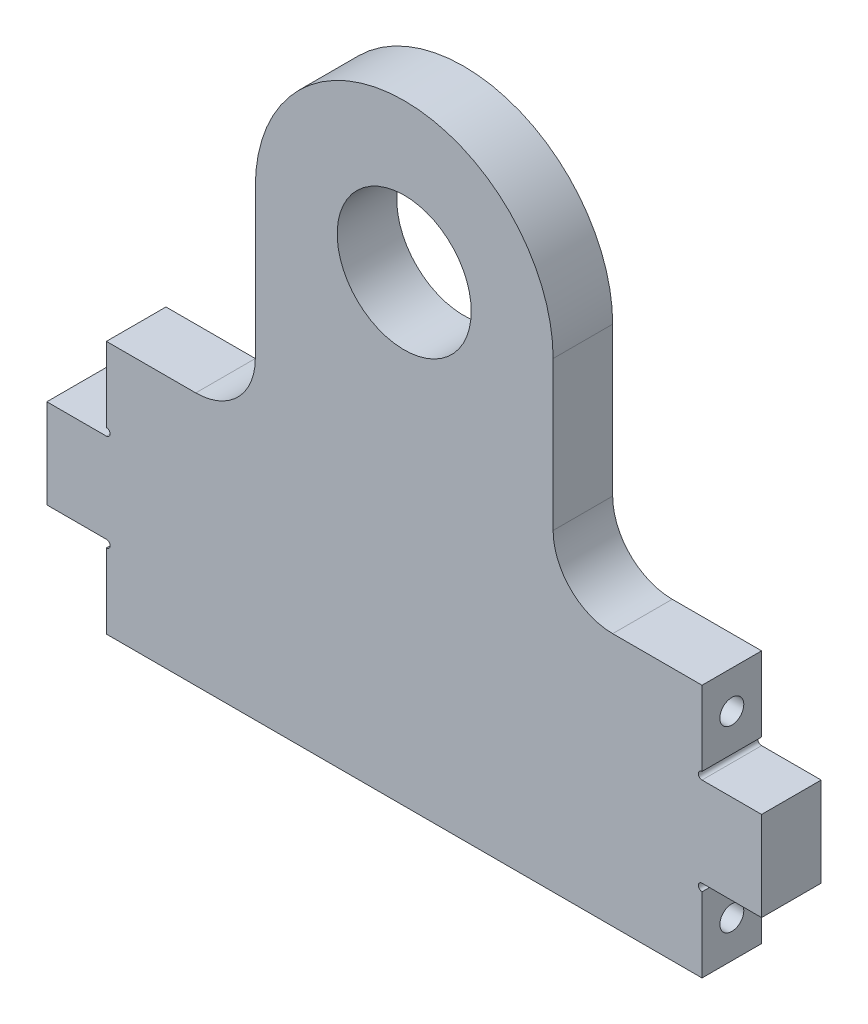
ISO-10303-21;
HEADER;
FILE_DESCRIPTION(('STEP AP214'),'2;1');
FILE_NAME('part.step','',(''),(''),'','','');
FILE_SCHEMA(('AUTOMOTIVE_DESIGN { 1 0 10303 214 1 1 1 1 }'));
ENDSEC;
DATA;
#1=APPLICATION_CONTEXT('core data for automotive mechanical design processes');
#2=APPLICATION_PROTOCOL_DEFINITION('international standard','automotive_design',2000,#1);
#3=PRODUCT_CONTEXT('',#1,'mechanical');
#4=PRODUCT('Part','Part','',(#3));
#5=PRODUCT_RELATED_PRODUCT_CATEGORY('part','',(#4));
#6=PRODUCT_DEFINITION_FORMATION('','',#4);
#7=PRODUCT_DEFINITION_CONTEXT('part definition',#1,'design');
#8=PRODUCT_DEFINITION('design','',#6,#7);
#9=PRODUCT_DEFINITION_SHAPE('','',#8);
#10=(LENGTH_UNIT() NAMED_UNIT(*) SI_UNIT(.MILLI.,.METRE.));
#11=(NAMED_UNIT(*) PLANE_ANGLE_UNIT() SI_UNIT($,.RADIAN.));
#12=(NAMED_UNIT(*) SI_UNIT($,.STERADIAN.) SOLID_ANGLE_UNIT());
#13=UNCERTAINTY_MEASURE_WITH_UNIT(LENGTH_MEASURE(1.E-05),#10,'distance_accuracy_value','');
#14=(GEOMETRIC_REPRESENTATION_CONTEXT(3) GLOBAL_UNCERTAINTY_ASSIGNED_CONTEXT((#13)) GLOBAL_UNIT_ASSIGNED_CONTEXT((#10,
#11,#12)) REPRESENTATION_CONTEXT('',''));
#15=CARTESIAN_POINT('',(0.,0.,0.));
#16=DIRECTION('',(0.,0.,1.));
#17=DIRECTION('',(1.,0.,0.));
#18=AXIS2_PLACEMENT_3D('',#15,#16,#17);
#19=CARTESIAN_POINT('',(0.,0.,12.7));
#20=DIRECTION('',(0.,0.,-1.));
#21=DIRECTION('',(-1.,0.,0.));
#22=AXIS2_PLACEMENT_3D('',#19,#20,#21);
#23=PLANE('',#22);
#24=CARTESIAN_POINT('',(0.,95.25,12.7));
#25=DIRECTION('',(0.,0.,1.));
#26=DIRECTION('',(1.,0.,0.));
#27=AXIS2_PLACEMENT_3D('',#24,#25,#26);
#28=CIRCLE('',#27,14.2875);
#29=CARTESIAN_POINT('',(14.2875,95.25,12.7));
#30=VERTEX_POINT('',#29);
#31=EDGE_CURVE('E238',#30,#30,#28,.T.);
#32=ORIENTED_EDGE('',*,*,#31,.F.);
#33=EDGE_LOOP('',(#32));
#34=FACE_BOUND('',#33,.T.);
#35=CARTESIAN_POINT('',(-63.5000000000001,13.4505000595411,12.7));
#36=DIRECTION('',(0.,0.,-1.));
#37=DIRECTION('',(-1.,0.,0.));
#38=AXIS2_PLACEMENT_3D('',#35,#36,#37);
#39=CIRCLE('',#38,0.793749999999993);
#40=CARTESIAN_POINT('',(-63.5,14.2442500595411,12.7));
#41=VERTEX_POINT('',#40);
#42=CARTESIAN_POINT('',(-63.5,12.6567500595411,12.7));
#43=VERTEX_POINT('',#42);
#44=EDGE_CURVE('E202',#41,#43,#39,.T.);
#45=ORIENTED_EDGE('',*,*,#44,.T.);
#46=DIRECTION('',(0.,-1.,0.));
#47=VECTOR('',#46,1.);
#48=CARTESIAN_POINT('',(-63.5,0.,12.7));
#49=LINE('',#48,#47);
#50=CARTESIAN_POINT('',(-63.5,-3.26149988091779,12.7));
#51=VERTEX_POINT('',#50);
#52=EDGE_CURVE('E213',#43,#51,#49,.T.);
#53=ORIENTED_EDGE('',*,*,#52,.T.);
#54=DIRECTION('',(1.,0.,0.));
#55=VECTOR('',#54,1.);
#56=CARTESIAN_POINT('',(-63.5,-3.26149988091779,12.7));
#57=LINE('',#56,#55);
#58=CARTESIAN_POINT('',(63.5000000000001,-3.26149988091779,12.7));
#59=VERTEX_POINT('',#58);
#60=EDGE_CURVE('E323',#51,#59,#57,.T.);
#61=ORIENTED_EDGE('',*,*,#60,.T.);
#62=DIRECTION('',(0.,1.,0.));
#63=VECTOR('',#62,1.);
#64=CARTESIAN_POINT('',(63.5,0.,12.7));
#65=LINE('',#64,#63);
#66=CARTESIAN_POINT('',(63.5,12.6567500595411,12.7));
#67=VERTEX_POINT('',#66);
#68=EDGE_CURVE('E262',#59,#67,#65,.T.);
#69=ORIENTED_EDGE('',*,*,#68,.T.);
#70=CARTESIAN_POINT('',(63.5000000000001,13.4505000595411,12.7));
#71=DIRECTION('',(0.,0.,1.));
#72=DIRECTION('',(1.,0.,0.));
#73=AXIS2_PLACEMENT_3D('',#70,#71,#72);
#74=CIRCLE('',#73,0.793749999999993);
#75=CARTESIAN_POINT('',(63.5000000000001,14.2442500595411,12.7));
#76=VERTEX_POINT('',#75);
#77=EDGE_CURVE('E462',#76,#67,#74,.T.);
#78=ORIENTED_EDGE('',*,*,#77,.F.);
#79=DIRECTION('',(-1.,0.,0.));
#80=VECTOR('',#79,1.);
#81=CARTESIAN_POINT('',(76.2,14.2442500595411,12.7));
#82=LINE('',#81,#80);
#83=CARTESIAN_POINT('',(76.2,14.2442500595411,12.7));
#84=VERTEX_POINT('',#83);
#85=EDGE_CURVE('E300',#84,#76,#82,.T.);
#86=ORIENTED_EDGE('',*,*,#85,.F.);
#87=DIRECTION('',(0.,-1.,0.));
#88=VECTOR('',#87,1.);
#89=CARTESIAN_POINT('',(76.2,33.2942500595411,12.7));
#90=LINE('',#89,#88);
#91=CARTESIAN_POINT('',(76.2,33.2942500595411,12.7));
#92=VERTEX_POINT('',#91);
#93=EDGE_CURVE('E285',#92,#84,#90,.T.);
#94=ORIENTED_EDGE('',*,*,#93,.F.);
#95=DIRECTION('',(-1.,0.,0.));
#96=VECTOR('',#95,1.);
#97=CARTESIAN_POINT('',(76.2,33.2942500595411,12.7));
#98=LINE('',#97,#96);
#99=CARTESIAN_POINT('',(63.5,33.2942500595411,12.7));
#100=VERTEX_POINT('',#99);
#101=EDGE_CURVE('E288',#92,#100,#98,.T.);
#102=ORIENTED_EDGE('',*,*,#101,.T.);
#103=CARTESIAN_POINT('',(63.5,34.0880000595411,12.7));
#104=DIRECTION('',(0.,0.,1.));
#105=DIRECTION('',(1.,0.,0.));
#106=AXIS2_PLACEMENT_3D('',#103,#104,#105);
#107=CIRCLE('',#106,0.793749999999993);
#108=CARTESIAN_POINT('',(63.5,34.8817500595411,12.7));
#109=VERTEX_POINT('',#108);
#110=EDGE_CURVE('E53',#109,#100,#107,.T.);
#111=ORIENTED_EDGE('',*,*,#110,.F.);
#112=CARTESIAN_POINT('',(63.5,50.8,12.7));
#113=VERTEX_POINT('',#112);
#114=EDGE_CURVE('E226',#109,#113,#65,.T.);
#115=ORIENTED_EDGE('',*,*,#114,.T.);
#116=DIRECTION('',(1.,0.,0.));
#117=VECTOR('',#116,1.);
#118=CARTESIAN_POINT('',(31.75,50.8,12.7));
#119=LINE('',#118,#117);
#120=CARTESIAN_POINT('',(44.45,50.8,12.7));
#121=VERTEX_POINT('',#120);
#122=EDGE_CURVE('E352',#121,#113,#119,.T.);
#123=ORIENTED_EDGE('',*,*,#122,.F.);
#124=CARTESIAN_POINT('',(44.45,63.5,12.7));
#125=DIRECTION('',(0.,0.,-1.));
#126=DIRECTION('',(-1.,0.,0.));
#127=AXIS2_PLACEMENT_3D('',#124,#125,#126);
#128=CIRCLE('',#127,12.7);
#129=CARTESIAN_POINT('',(31.75,63.5,12.7));
#130=VERTEX_POINT('',#129);
#131=EDGE_CURVE('E45',#121,#130,#128,.T.);
#132=ORIENTED_EDGE('',*,*,#131,.T.);
#133=DIRECTION('',(0.,-1.,0.));
#134=VECTOR('',#133,1.);
#135=CARTESIAN_POINT('',(31.75,95.25,12.7));
#136=LINE('',#135,#134);
#137=CARTESIAN_POINT('',(31.75,95.25,12.7));
#138=VERTEX_POINT('',#137);
#139=EDGE_CURVE('E350',#138,#130,#136,.T.);
#140=ORIENTED_EDGE('',*,*,#139,.F.);
#141=CARTESIAN_POINT('',(0.,95.25,12.7));
#142=DIRECTION('',(0.,0.,-1.));
#143=DIRECTION('',(1.,0.,0.));
#144=AXIS2_PLACEMENT_3D('',#141,#142,#143);
#145=CIRCLE('',#144,31.75);
#146=CARTESIAN_POINT('',(-31.75,95.25,12.7));
#147=VERTEX_POINT('',#146);
#148=EDGE_CURVE('E331',#147,#138,#145,.T.);
#149=ORIENTED_EDGE('',*,*,#148,.F.);
#150=DIRECTION('',(0.,1.,0.));
#151=VECTOR('',#150,1.);
#152=CARTESIAN_POINT('',(-31.75,50.8,12.7));
#153=LINE('',#152,#151);
#154=CARTESIAN_POINT('',(-31.75,63.5,12.7));
#155=VERTEX_POINT('',#154);
#156=EDGE_CURVE('E337',#155,#147,#153,.T.);
#157=ORIENTED_EDGE('',*,*,#156,.F.);
#158=CARTESIAN_POINT('',(-44.45,63.5,12.7));
#159=DIRECTION('',(0.,0.,-1.));
#160=DIRECTION('',(-1.,0.,0.));
#161=AXIS2_PLACEMENT_3D('',#158,#159,#160);
#162=CIRCLE('',#161,12.7);
#163=CARTESIAN_POINT('',(-44.45,50.8,12.7));
#164=VERTEX_POINT('',#163);
#165=EDGE_CURVE('E414',#155,#164,#162,.T.);
#166=ORIENTED_EDGE('',*,*,#165,.T.);
#167=DIRECTION('',(1.,0.,0.));
#168=VECTOR('',#167,1.);
#169=CARTESIAN_POINT('',(-63.5,50.8,12.7));
#170=LINE('',#169,#168);
#171=CARTESIAN_POINT('',(-63.5,50.8,12.7));
#172=VERTEX_POINT('',#171);
#173=EDGE_CURVE('E355',#172,#164,#170,.T.);
#174=ORIENTED_EDGE('',*,*,#173,.F.);
#175=CARTESIAN_POINT('',(-63.5,34.8817500595411,12.7));
#176=VERTEX_POINT('',#175);
#177=EDGE_CURVE('E223',#172,#176,#49,.T.);
#178=ORIENTED_EDGE('',*,*,#177,.T.);
#179=CARTESIAN_POINT('',(-63.5,34.0880000595411,12.7));
#180=DIRECTION('',(0.,0.,-1.));
#181=DIRECTION('',(-1.,0.,0.));
#182=AXIS2_PLACEMENT_3D('',#179,#180,#181);
#183=CIRCLE('',#182,0.793749999999993);
#184=CARTESIAN_POINT('',(-63.5,33.2942500595411,12.7));
#185=VERTEX_POINT('',#184);
#186=EDGE_CURVE('E209',#176,#185,#183,.T.);
#187=ORIENTED_EDGE('',*,*,#186,.T.);
#188=DIRECTION('',(1.,0.,0.));
#189=VECTOR('',#188,1.);
#190=CARTESIAN_POINT('',(-76.2,33.2942500595411,12.7));
#191=LINE('',#190,#189);
#192=CARTESIAN_POINT('',(-76.2,33.2942500595411,12.7));
#193=VERTEX_POINT('',#192);
#194=EDGE_CURVE('E784',#193,#185,#191,.T.);
#195=ORIENTED_EDGE('',*,*,#194,.F.);
#196=DIRECTION('',(0.,-1.,0.));
#197=VECTOR('',#196,1.);
#198=CARTESIAN_POINT('',(-76.2,33.2942500595411,12.7));
#199=LINE('',#198,#197);
#200=CARTESIAN_POINT('',(-76.2,14.2442500595411,12.7));
#201=VERTEX_POINT('',#200);
#202=EDGE_CURVE('E791',#193,#201,#199,.T.);
#203=ORIENTED_EDGE('',*,*,#202,.T.);
#204=DIRECTION('',(1.,0.,0.));
#205=VECTOR('',#204,1.);
#206=CARTESIAN_POINT('',(-76.2,14.2442500595411,12.7));
#207=LINE('',#206,#205);
#208=EDGE_CURVE('E216',#201,#41,#207,.T.);
#209=ORIENTED_EDGE('',*,*,#208,.T.);
#210=EDGE_LOOP('',(#45,#53,#61,#69,#78,#86,#94,#102,#111,#115,#123,#132,#140,#149,#157,#166,
#174,#178,#187,#195,#203,#209));
#211=FACE_BOUND('',#210,.T.);
#212=ADVANCED_FACE('F35',(#34,#211),#23,.F.);
#213=CARTESIAN_POINT('',(0.,0.,0.));
#214=DIRECTION('',(0.,0.,-1.));
#215=DIRECTION('',(-1.,0.,0.));
#216=AXIS2_PLACEMENT_3D('',#213,#214,#215);
#217=PLANE('',#216);
#218=CARTESIAN_POINT('',(0.,95.25,0.));
#219=DIRECTION('',(0.,0.,1.));
#220=DIRECTION('',(1.,0.,0.));
#221=AXIS2_PLACEMENT_3D('',#218,#219,#220);
#222=CIRCLE('',#221,14.2875);
#223=CARTESIAN_POINT('',(14.2875,95.25,0.));
#224=VERTEX_POINT('',#223);
#225=EDGE_CURVE('E367',#224,#224,#222,.T.);
#226=ORIENTED_EDGE('',*,*,#225,.T.);
#227=EDGE_LOOP('',(#226));
#228=FACE_BOUND('',#227,.T.);
#229=DIRECTION('',(0.,-1.,0.));
#230=VECTOR('',#229,1.);
#231=CARTESIAN_POINT('',(-63.5,0.,0.));
#232=LINE('',#231,#230);
#233=CARTESIAN_POINT('',(-63.5,12.6567500595411,0.));
#234=VERTEX_POINT('',#233);
#235=CARTESIAN_POINT('',(-63.5,-3.26149988091779,0.));
#236=VERTEX_POINT('',#235);
#237=EDGE_CURVE('E39',#234,#236,#232,.T.);
#238=ORIENTED_EDGE('',*,*,#237,.F.);
#239=CARTESIAN_POINT('',(-63.5000000000001,13.4505000595411,0.));
#240=DIRECTION('',(0.,0.,-1.));
#241=DIRECTION('',(-1.,0.,0.));
#242=AXIS2_PLACEMENT_3D('',#239,#240,#241);
#243=CIRCLE('',#242,0.793749999999993);
#244=CARTESIAN_POINT('',(-63.5000000000001,14.2442500595411,0.));
#245=VERTEX_POINT('',#244);
#246=EDGE_CURVE('E205',#234,#245,#243,.F.);
#247=ORIENTED_EDGE('',*,*,#246,.T.);
#248=DIRECTION('',(1.,0.,0.));
#249=VECTOR('',#248,1.);
#250=CARTESIAN_POINT('',(-76.2,14.2442500595411,0.));
#251=LINE('',#250,#249);
#252=CARTESIAN_POINT('',(-76.2,14.2442500595411,0.));
#253=VERTEX_POINT('',#252);
#254=EDGE_CURVE('E794',#253,#245,#251,.T.);
#255=ORIENTED_EDGE('',*,*,#254,.F.);
#256=DIRECTION('',(0.,1.,0.));
#257=VECTOR('',#256,1.);
#258=CARTESIAN_POINT('',(-76.2,33.2942500595411,0.));
#259=LINE('',#258,#257);
#260=CARTESIAN_POINT('',(-76.2,33.2942500595411,0.));
#261=VERTEX_POINT('',#260);
#262=EDGE_CURVE('E799',#253,#261,#259,.T.);
#263=ORIENTED_EDGE('',*,*,#262,.T.);
#264=DIRECTION('',(1.,0.,0.));
#265=VECTOR('',#264,1.);
#266=CARTESIAN_POINT('',(-76.2,33.2942500595411,0.));
#267=LINE('',#266,#265);
#268=CARTESIAN_POINT('',(-63.5,33.2942500595411,0.));
#269=VERTEX_POINT('',#268);
#270=EDGE_CURVE('E797',#261,#269,#267,.T.);
#271=ORIENTED_EDGE('',*,*,#270,.T.);
#272=CARTESIAN_POINT('',(-63.5,34.0880000595411,0.));
#273=DIRECTION('',(0.,0.,-1.));
#274=DIRECTION('',(-1.,0.,0.));
#275=AXIS2_PLACEMENT_3D('',#272,#273,#274);
#276=CIRCLE('',#275,0.793749999999993);
#277=CARTESIAN_POINT('',(-63.5,34.8817500595411,0.));
#278=VERTEX_POINT('',#277);
#279=EDGE_CURVE('E810',#269,#278,#276,.F.);
#280=ORIENTED_EDGE('',*,*,#279,.T.);
#281=CARTESIAN_POINT('',(-63.5,50.8,0.));
#282=VERTEX_POINT('',#281);
#283=EDGE_CURVE('E245',#282,#278,#232,.T.);
#284=ORIENTED_EDGE('',*,*,#283,.F.);
#285=DIRECTION('',(1.,0.,0.));
#286=VECTOR('',#285,1.);
#287=CARTESIAN_POINT('',(-63.5,50.8,0.));
#288=LINE('',#287,#286);
#289=CARTESIAN_POINT('',(-44.45,50.8,0.));
#290=VERTEX_POINT('',#289);
#291=EDGE_CURVE('E342',#282,#290,#288,.T.);
#292=ORIENTED_EDGE('',*,*,#291,.T.);
#293=CARTESIAN_POINT('',(-44.45,63.5,0.));
#294=DIRECTION('',(0.,0.,-1.));
#295=DIRECTION('',(-1.,0.,0.));
#296=AXIS2_PLACEMENT_3D('',#293,#294,#295);
#297=CIRCLE('',#296,12.7);
#298=CARTESIAN_POINT('',(-31.75,63.5,0.));
#299=VERTEX_POINT('',#298);
#300=EDGE_CURVE('E410',#290,#299,#297,.F.);
#301=ORIENTED_EDGE('',*,*,#300,.T.);
#302=DIRECTION('',(0.,1.,0.));
#303=VECTOR('',#302,1.);
#304=CARTESIAN_POINT('',(-31.75,50.8,0.));
#305=LINE('',#304,#303);
#306=CARTESIAN_POINT('',(-31.75,95.25,0.));
#307=VERTEX_POINT('',#306);
#308=EDGE_CURVE('E345',#299,#307,#305,.T.);
#309=ORIENTED_EDGE('',*,*,#308,.T.);
#310=CARTESIAN_POINT('',(0.,95.25,0.));
#311=DIRECTION('',(0.,0.,-1.));
#312=DIRECTION('',(1.,0.,0.));
#313=AXIS2_PLACEMENT_3D('',#310,#311,#312);
#314=CIRCLE('',#313,31.75);
#315=CARTESIAN_POINT('',(31.75,95.25,0.));
#316=VERTEX_POINT('',#315);
#317=EDGE_CURVE('E333',#307,#316,#314,.T.);
#318=ORIENTED_EDGE('',*,*,#317,.T.);
#319=DIRECTION('',(0.,-1.,0.));
#320=VECTOR('',#319,1.);
#321=CARTESIAN_POINT('',(31.75,95.25,0.));
#322=LINE('',#321,#320);
#323=CARTESIAN_POINT('',(31.75,63.5,0.));
#324=VERTEX_POINT('',#323);
#325=EDGE_CURVE('E336',#316,#324,#322,.T.);
#326=ORIENTED_EDGE('',*,*,#325,.T.);
#327=CARTESIAN_POINT('',(44.45,63.5,0.));
#328=DIRECTION('',(0.,0.,-1.));
#329=DIRECTION('',(-1.,0.,0.));
#330=AXIS2_PLACEMENT_3D('',#327,#328,#329);
#331=CIRCLE('',#330,12.7);
#332=CARTESIAN_POINT('',(44.45,50.8,0.));
#333=VERTEX_POINT('',#332);
#334=EDGE_CURVE('E11',#324,#333,#331,.F.);
#335=ORIENTED_EDGE('',*,*,#334,.T.);
#336=DIRECTION('',(1.,0.,0.));
#337=VECTOR('',#336,1.);
#338=CARTESIAN_POINT('',(31.75,50.8,0.));
#339=LINE('',#338,#337);
#340=CARTESIAN_POINT('',(63.5,50.8,0.));
#341=VERTEX_POINT('',#340);
#342=EDGE_CURVE('E339',#333,#341,#339,.T.);
#343=ORIENTED_EDGE('',*,*,#342,.T.);
#344=DIRECTION('',(0.,1.,0.));
#345=VECTOR('',#344,1.);
#346=CARTESIAN_POINT('',(63.5,0.,0.));
#347=LINE('',#346,#345);
#348=CARTESIAN_POINT('',(63.5,34.8817500595411,0.));
#349=VERTEX_POINT('',#348);
#350=EDGE_CURVE('E229',#349,#341,#347,.T.);
#351=ORIENTED_EDGE('',*,*,#350,.F.);
#352=CARTESIAN_POINT('',(63.5,34.0880000595411,0.));
#353=DIRECTION('',(0.,0.,-1.));
#354=DIRECTION('',(-1.,0.,0.));
#355=AXIS2_PLACEMENT_3D('',#352,#353,#354);
#356=CIRCLE('',#355,0.793749999999993);
#357=CARTESIAN_POINT('',(63.5,33.2942500595411,0.));
#358=VERTEX_POINT('',#357);
#359=EDGE_CURVE('E443',#358,#349,#356,.T.);
#360=ORIENTED_EDGE('',*,*,#359,.F.);
#361=DIRECTION('',(-1.,0.,0.));
#362=VECTOR('',#361,1.);
#363=CARTESIAN_POINT('',(76.2,33.2942500595411,0.));
#364=LINE('',#363,#362);
#365=CARTESIAN_POINT('',(76.2,33.2942500595411,0.));
#366=VERTEX_POINT('',#365);
#367=EDGE_CURVE('E291',#366,#358,#364,.T.);
#368=ORIENTED_EDGE('',*,*,#367,.F.);
#369=DIRECTION('',(0.,1.,0.));
#370=VECTOR('',#369,1.);
#371=CARTESIAN_POINT('',(76.2,33.2942500595411,0.));
#372=LINE('',#371,#370);
#373=CARTESIAN_POINT('',(76.2,14.2442500595411,0.));
#374=VERTEX_POINT('',#373);
#375=EDGE_CURVE('E455',#374,#366,#372,.T.);
#376=ORIENTED_EDGE('',*,*,#375,.F.);
#377=DIRECTION('',(-1.,0.,0.));
#378=VECTOR('',#377,1.);
#379=CARTESIAN_POINT('',(76.2,14.2442500595411,0.));
#380=LINE('',#379,#378);
#381=CARTESIAN_POINT('',(63.5,14.2442500595411,0.));
#382=VERTEX_POINT('',#381);
#383=EDGE_CURVE('E271',#374,#382,#380,.T.);
#384=ORIENTED_EDGE('',*,*,#383,.T.);
#385=CARTESIAN_POINT('',(63.5000000000001,13.4505000595411,0.));
#386=DIRECTION('',(0.,0.,-1.));
#387=DIRECTION('',(-1.,0.,0.));
#388=AXIS2_PLACEMENT_3D('',#385,#386,#387);
#389=CIRCLE('',#388,0.793749999999993);
#390=CARTESIAN_POINT('',(63.5,12.6567500595411,0.));
#391=VERTEX_POINT('',#390);
#392=EDGE_CURVE('E465',#391,#382,#389,.T.);
#393=ORIENTED_EDGE('',*,*,#392,.F.);
#394=CARTESIAN_POINT('',(63.5000000000001,-3.26149988091779,0.));
#395=VERTEX_POINT('',#394);
#396=EDGE_CURVE('E224',#395,#391,#347,.T.);
#397=ORIENTED_EDGE('',*,*,#396,.F.);
#398=DIRECTION('',(1.,0.,0.));
#399=VECTOR('',#398,1.);
#400=CARTESIAN_POINT('',(-63.5,-3.26149988091779,0.));
#401=LINE('',#400,#399);
#402=EDGE_CURVE('E324',#236,#395,#401,.T.);
#403=ORIENTED_EDGE('',*,*,#402,.F.);
#404=EDGE_LOOP('',(#238,#247,#255,#263,#271,#280,#284,#292,#301,#309,#318,#326,#335,#343,#351,
#360,#368,#376,#384,#393,#397,#403));
#405=FACE_BOUND('',#404,.T.);
#406=ADVANCED_FACE('F377',(#228,#405),#217,.T.);
#407=CARTESIAN_POINT('',(-63.5,0.,12.7));
#408=DIRECTION('',(1.,0.,0.));
#409=DIRECTION('',(0.,0.,-1.));
#410=AXIS2_PLACEMENT_3D('',#407,#408,#409);
#411=PLANE('',#410);
#412=CARTESIAN_POINT('',(-63.5,4.7192500595411,6.35));
#413=DIRECTION('',(-1.,0.,0.));
#414=DIRECTION('',(0.,0.,1.));
#415=AXIS2_PLACEMENT_3D('',#412,#413,#414);
#416=CIRCLE('',#415,2.55269999999999);
#417=CARTESIAN_POINT('',(-63.5,4.7192500595411,8.90269999999999));
#418=VERTEX_POINT('',#417);
#419=EDGE_CURVE('E470',#418,#418,#416,.T.);
#420=ORIENTED_EDGE('',*,*,#419,.F.);
#421=EDGE_LOOP('',(#420));
#422=FACE_BOUND('',#421,.T.);
#423=DIRECTION('',(0.,0.,1.));
#424=VECTOR('',#423,1.);
#425=CARTESIAN_POINT('',(-63.5,12.6567500595411,-4.99999999997031E-05));
#426=LINE('',#425,#424);
#427=EDGE_CURVE('E199',#234,#43,#426,.T.);
#428=ORIENTED_EDGE('',*,*,#427,.F.);
#429=ORIENTED_EDGE('',*,*,#237,.T.);
#430=DIRECTION('',(0.,0.,1.));
#431=VECTOR('',#430,1.);
#432=CARTESIAN_POINT('',(-63.5,-3.26149988091779,0.));
#433=LINE('',#432,#431);
#434=EDGE_CURVE('E221',#236,#51,#433,.T.);
#435=ORIENTED_EDGE('',*,*,#434,.T.);
#436=ORIENTED_EDGE('',*,*,#52,.F.);
#437=EDGE_LOOP('',(#428,#429,#435,#436));
#438=FACE_BOUND('',#437,.T.);
#439=ADVANCED_FACE('F219',(#422,#438),#411,.F.);
#440=CARTESIAN_POINT('',(-63.5,42.8192500595411,6.35));
#441=DIRECTION('',(-1.,0.,0.));
#442=DIRECTION('',(0.,0.,1.));
#443=AXIS2_PLACEMENT_3D('',#440,#441,#442);
#444=CIRCLE('',#443,2.55269999999999);
#445=CARTESIAN_POINT('',(-63.5,42.8192500595411,8.9027));
#446=VERTEX_POINT('',#445);
#447=EDGE_CURVE('E779',#446,#446,#444,.T.);
#448=ORIENTED_EDGE('',*,*,#447,.F.);
#449=EDGE_LOOP('',(#448));
#450=FACE_BOUND('',#449,.T.);
#451=DIRECTION('',(0.,0.,1.));
#452=VECTOR('',#451,1.);
#453=CARTESIAN_POINT('',(-63.5,34.8817500595411,-4.99999999997031E-05));
#454=LINE('',#453,#452);
#455=EDGE_CURVE('E808',#176,#278,#454,.F.);
#456=ORIENTED_EDGE('',*,*,#455,.F.);
#457=ORIENTED_EDGE('',*,*,#177,.F.);
#458=DIRECTION('',(0.,0.,1.));
#459=VECTOR('',#458,1.);
#460=CARTESIAN_POINT('',(-63.5,50.8,0.));
#461=LINE('',#460,#459);
#462=EDGE_CURVE('E362',#282,#172,#461,.T.);
#463=ORIENTED_EDGE('',*,*,#462,.F.);
#464=ORIENTED_EDGE('',*,*,#283,.T.);
#465=EDGE_LOOP('',(#456,#457,#463,#464));
#466=FACE_BOUND('',#465,.T.);
#467=ADVANCED_FACE('F391',(#450,#466),#411,.F.);
#468=CARTESIAN_POINT('',(63.5,0.,12.7));
#469=DIRECTION('',(-1.,0.,0.));
#470=DIRECTION('',(0.,0.,1.));
#471=AXIS2_PLACEMENT_3D('',#468,#469,#470);
#472=PLANE('',#471);
#473=CARTESIAN_POINT('',(63.5,42.8192500595411,6.35));
#474=DIRECTION('',(1.,0.,0.));
#475=DIRECTION('',(0.,0.,-1.));
#476=AXIS2_PLACEMENT_3D('',#473,#474,#475);
#477=CIRCLE('',#476,2.55269999999999);
#478=CARTESIAN_POINT('',(63.5,42.8192500595411,3.79730000000001));
#479=VERTEX_POINT('',#478);
#480=EDGE_CURVE('E280',#479,#479,#477,.T.);
#481=ORIENTED_EDGE('',*,*,#480,.F.);
#482=EDGE_LOOP('',(#481));
#483=FACE_BOUND('',#482,.T.);
#484=ORIENTED_EDGE('',*,*,#114,.F.);
#485=DIRECTION('',(0.,0.,1.));
#486=VECTOR('',#485,1.);
#487=CARTESIAN_POINT('',(63.5,34.8817500595411,-4.99999999997031E-05));
#488=LINE('',#487,#486);
#489=EDGE_CURVE('E270',#109,#349,#488,.F.);
#490=ORIENTED_EDGE('',*,*,#489,.T.);
#491=ORIENTED_EDGE('',*,*,#350,.T.);
#492=DIRECTION('',(0.,0.,1.));
#493=VECTOR('',#492,1.);
#494=CARTESIAN_POINT('',(63.5,50.8,0.));
#495=LINE('',#494,#493);
#496=EDGE_CURVE('E364',#341,#113,#495,.T.);
#497=ORIENTED_EDGE('',*,*,#496,.T.);
#498=EDGE_LOOP('',(#484,#490,#491,#497));
#499=FACE_BOUND('',#498,.T.);
#500=ADVANCED_FACE('F387',(#483,#499),#472,.F.);
#501=CARTESIAN_POINT('',(63.5,4.7192500595411,6.35));
#502=DIRECTION('',(1.,0.,0.));
#503=DIRECTION('',(0.,0.,-1.));
#504=AXIS2_PLACEMENT_3D('',#501,#502,#503);
#505=CIRCLE('',#504,2.55269999999999);
#506=CARTESIAN_POINT('',(63.5,4.7192500595411,3.79730000000001));
#507=VERTEX_POINT('',#506);
#508=EDGE_CURVE('E314',#507,#507,#505,.T.);
#509=ORIENTED_EDGE('',*,*,#508,.F.);
#510=EDGE_LOOP('',(#509));
#511=FACE_BOUND('',#510,.T.);
#512=ORIENTED_EDGE('',*,*,#396,.T.);
#513=DIRECTION('',(0.,0.,1.));
#514=VECTOR('',#513,1.);
#515=CARTESIAN_POINT('',(63.5,12.6567500595411,-4.99999999997031E-05));
#516=LINE('',#515,#514);
#517=EDGE_CURVE('E446',#391,#67,#516,.T.);
#518=ORIENTED_EDGE('',*,*,#517,.T.);
#519=ORIENTED_EDGE('',*,*,#68,.F.);
#520=DIRECTION('',(0.,0.,1.));
#521=VECTOR('',#520,1.);
#522=CARTESIAN_POINT('',(63.5000000000001,-3.26149988091779,0.));
#523=LINE('',#522,#521);
#524=EDGE_CURVE('E328',#395,#59,#523,.T.);
#525=ORIENTED_EDGE('',*,*,#524,.F.);
#526=EDGE_LOOP('',(#512,#518,#519,#525));
#527=FACE_BOUND('',#526,.T.);
#528=ADVANCED_FACE('F390',(#511,#527),#472,.F.);
#529=CARTESIAN_POINT('',(0.,95.25,0.));
#530=DIRECTION('',(0.,0.,1.));
#531=DIRECTION('',(1.,0.,0.));
#532=AXIS2_PLACEMENT_3D('',#529,#530,#531);
#533=CYLINDRICAL_SURFACE('',#532,14.2875);
#534=ORIENTED_EDGE('',*,*,#225,.F.);
#535=EDGE_LOOP('',(#534));
#536=FACE_BOUND('',#535,.T.);
#537=ORIENTED_EDGE('',*,*,#31,.T.);
#538=EDGE_LOOP('',(#537));
#539=FACE_BOUND('',#538,.T.);
#540=ADVANCED_FACE('F374',(#536,#539),#533,.F.);
#541=CARTESIAN_POINT('',(0.,95.25,0.));
#542=DIRECTION('',(0.,0.,1.));
#543=DIRECTION('',(1.,0.,0.));
#544=AXIS2_PLACEMENT_3D('',#541,#542,#543);
#545=CYLINDRICAL_SURFACE('',#544,31.75);
#546=ORIENTED_EDGE('',*,*,#148,.T.);
#547=DIRECTION('',(0.,0.,1.));
#548=VECTOR('',#547,1.);
#549=CARTESIAN_POINT('',(31.75,95.25,0.));
#550=LINE('',#549,#548);
#551=EDGE_CURVE('E347',#316,#138,#550,.T.);
#552=ORIENTED_EDGE('',*,*,#551,.F.);
#553=ORIENTED_EDGE('',*,*,#317,.F.);
#554=DIRECTION('',(0.,0.,1.));
#555=VECTOR('',#554,1.);
#556=CARTESIAN_POINT('',(-31.75,95.25,0.));
#557=LINE('',#556,#555);
#558=EDGE_CURVE('E359',#307,#147,#557,.T.);
#559=ORIENTED_EDGE('',*,*,#558,.T.);
#560=EDGE_LOOP('',(#546,#552,#553,#559));
#561=FACE_BOUND('',#560,.T.);
#562=ADVANCED_FACE('F430',(#561),#545,.T.);
#563=CARTESIAN_POINT('',(-31.75,50.8,0.));
#564=DIRECTION('',(1.,0.,0.));
#565=DIRECTION('',(0.,0.,-1.));
#566=AXIS2_PLACEMENT_3D('',#563,#564,#565);
#567=PLANE('',#566);
#568=ORIENTED_EDGE('',*,*,#308,.F.);
#569=DIRECTION('',(0.,0.,1.));
#570=VECTOR('',#569,1.);
#571=CARTESIAN_POINT('',(-31.75,63.5,12.7));
#572=LINE('',#571,#570);
#573=EDGE_CURVE('E256',#299,#155,#572,.T.);
#574=ORIENTED_EDGE('',*,*,#573,.T.);
#575=ORIENTED_EDGE('',*,*,#156,.T.);
#576=ORIENTED_EDGE('',*,*,#558,.F.);
#577=EDGE_LOOP('',(#568,#574,#575,#576));
#578=FACE_BOUND('',#577,.T.);
#579=ADVANCED_FACE('F424',(#578),#567,.F.);
#580=CARTESIAN_POINT('',(-63.5,50.8,0.));
#581=DIRECTION('',(0.,-1.,0.));
#582=DIRECTION('',(0.,0.,-1.));
#583=AXIS2_PLACEMENT_3D('',#580,#581,#582);
#584=PLANE('',#583);
#585=ORIENTED_EDGE('',*,*,#173,.T.);
#586=DIRECTION('',(0.,0.,1.));
#587=VECTOR('',#586,1.);
#588=CARTESIAN_POINT('',(-44.45,50.8,0.));
#589=LINE('',#588,#587);
#590=EDGE_CURVE('E411',#164,#290,#589,.F.);
#591=ORIENTED_EDGE('',*,*,#590,.T.);
#592=ORIENTED_EDGE('',*,*,#291,.F.);
#593=ORIENTED_EDGE('',*,*,#462,.T.);
#594=EDGE_LOOP('',(#585,#591,#592,#593));
#595=FACE_BOUND('',#594,.T.);
#596=ADVANCED_FACE('F498',(#595),#584,.F.);
#597=CARTESIAN_POINT('',(31.75,50.8,0.));
#598=DIRECTION('',(0.,-1.,0.));
#599=DIRECTION('',(0.,0.,-1.));
#600=AXIS2_PLACEMENT_3D('',#597,#598,#599);
#601=PLANE('',#600);
#602=ORIENTED_EDGE('',*,*,#342,.F.);
#603=DIRECTION('',(0.,0.,1.));
#604=VECTOR('',#603,1.);
#605=CARTESIAN_POINT('',(44.45,50.8,12.7));
#606=LINE('',#605,#604);
#607=EDGE_CURVE('E419',#333,#121,#606,.T.);
#608=ORIENTED_EDGE('',*,*,#607,.T.);
#609=ORIENTED_EDGE('',*,*,#122,.T.);
#610=ORIENTED_EDGE('',*,*,#496,.F.);
#611=EDGE_LOOP('',(#602,#608,#609,#610));
#612=FACE_BOUND('',#611,.T.);
#613=ADVANCED_FACE('F405',(#612),#601,.F.);
#614=CARTESIAN_POINT('',(31.75,95.25,0.));
#615=DIRECTION('',(-1.,0.,0.));
#616=DIRECTION('',(0.,0.,1.));
#617=AXIS2_PLACEMENT_3D('',#614,#615,#616);
#618=PLANE('',#617);
#619=ORIENTED_EDGE('',*,*,#139,.T.);
#620=DIRECTION('',(0.,0.,1.));
#621=VECTOR('',#620,1.);
#622=CARTESIAN_POINT('',(31.75,63.5,0.));
#623=LINE('',#622,#621);
#624=EDGE_CURVE('E61',#130,#324,#623,.F.);
#625=ORIENTED_EDGE('',*,*,#624,.T.);
#626=ORIENTED_EDGE('',*,*,#325,.F.);
#627=ORIENTED_EDGE('',*,*,#551,.T.);
#628=EDGE_LOOP('',(#619,#625,#626,#627));
#629=FACE_BOUND('',#628,.T.);
#630=ADVANCED_FACE('F397',(#629),#618,.F.);
#631=CARTESIAN_POINT('',(-44.45,63.5,0.));
#632=DIRECTION('',(0.,0.,-1.));
#633=DIRECTION('',(-1.,0.,0.));
#634=AXIS2_PLACEMENT_3D('',#631,#632,#633);
#635=CYLINDRICAL_SURFACE('',#634,12.7);
#636=ORIENTED_EDGE('',*,*,#300,.F.);
#637=ORIENTED_EDGE('',*,*,#590,.F.);
#638=ORIENTED_EDGE('',*,*,#165,.F.);
#639=ORIENTED_EDGE('',*,*,#573,.F.);
#640=EDGE_LOOP('',(#636,#637,#638,#639));
#641=FACE_BOUND('',#640,.T.);
#642=ADVANCED_FACE('F395',(#641),#635,.F.);
#643=CARTESIAN_POINT('',(44.45,63.5,0.));
#644=DIRECTION('',(0.,0.,-1.));
#645=DIRECTION('',(-1.,0.,0.));
#646=AXIS2_PLACEMENT_3D('',#643,#644,#645);
#647=CYLINDRICAL_SURFACE('',#646,12.7);
#648=ORIENTED_EDGE('',*,*,#334,.F.);
#649=ORIENTED_EDGE('',*,*,#624,.F.);
#650=ORIENTED_EDGE('',*,*,#131,.F.);
#651=ORIENTED_EDGE('',*,*,#607,.F.);
#652=EDGE_LOOP('',(#648,#649,#650,#651));
#653=FACE_BOUND('',#652,.T.);
#654=ADVANCED_FACE('F37',(#653),#647,.F.);
#655=CARTESIAN_POINT('',(-63.5,-3.26149988091779,0.));
#656=DIRECTION('',(0.,-1.,0.));
#657=DIRECTION('',(0.,0.,-1.));
#658=AXIS2_PLACEMENT_3D('',#655,#656,#657);
#659=PLANE('',#658);
#660=ORIENTED_EDGE('',*,*,#60,.F.);
#661=ORIENTED_EDGE('',*,*,#434,.F.);
#662=ORIENTED_EDGE('',*,*,#402,.T.);
#663=ORIENTED_EDGE('',*,*,#524,.T.);
#664=EDGE_LOOP('',(#660,#661,#662,#663));
#665=FACE_BOUND('',#664,.T.);
#666=ADVANCED_FACE('F403',(#665),#659,.T.);
#667=CARTESIAN_POINT('',(46.99,4.7192500595411,6.35));
#668=DIRECTION('',(1.,0.,0.));
#669=DIRECTION('',(0.,0.,-1.));
#670=AXIS2_PLACEMENT_3D('',#667,#668,#669);
#671=CONICAL_SURFACE('',#670,2.55269999999999,1.02974425867665);
#672=CARTESIAN_POINT('',(45.4561830978084,4.7192500595411,6.35));
#673=VERTEX_POINT('',#672);
#674=VERTEX_LOOP('',#673);
#675=FACE_BOUND('',#674,.T.);
#676=CARTESIAN_POINT('',(46.99,4.7192500595411,6.35));
#677=DIRECTION('',(1.,0.,0.));
#678=DIRECTION('',(0.,0.,-1.));
#679=AXIS2_PLACEMENT_3D('',#676,#677,#678);
#680=CIRCLE('',#679,2.55269999999999);
#681=CARTESIAN_POINT('',(46.99,4.7192500595411,3.79730000000001));
#682=VERTEX_POINT('',#681);
#683=EDGE_CURVE('E318',#682,#682,#680,.T.);
#684=ORIENTED_EDGE('',*,*,#683,.T.);
#685=EDGE_LOOP('',(#684));
#686=FACE_BOUND('',#685,.T.);
#687=ADVANCED_FACE('F485',(#675,#686),#671,.F.);
#688=CARTESIAN_POINT('',(63.5,4.7192500595411,6.35));
#689=DIRECTION('',(1.,0.,0.));
#690=DIRECTION('',(0.,0.,-1.));
#691=AXIS2_PLACEMENT_3D('',#688,#689,#690);
#692=CYLINDRICAL_SURFACE('',#691,2.55269999999999);
#693=ORIENTED_EDGE('',*,*,#683,.F.);
#694=EDGE_LOOP('',(#693));
#695=FACE_BOUND('',#694,.T.);
#696=ORIENTED_EDGE('',*,*,#508,.T.);
#697=EDGE_LOOP('',(#696));
#698=FACE_BOUND('',#697,.T.);
#699=ADVANCED_FACE('F491',(#695,#698),#692,.F.);
#700=CARTESIAN_POINT('',(46.99,42.8192500595411,6.35));
#701=DIRECTION('',(1.,0.,0.));
#702=DIRECTION('',(0.,0.,-1.));
#703=AXIS2_PLACEMENT_3D('',#700,#701,#702);
#704=CONICAL_SURFACE('',#703,2.55269999999998,1.02974425867665);
#705=CARTESIAN_POINT('',(45.4561830978084,42.8192500595411,6.35));
#706=VERTEX_POINT('',#705);
#707=VERTEX_LOOP('',#706);
#708=FACE_BOUND('',#707,.T.);
#709=CARTESIAN_POINT('',(46.99,42.8192500595411,6.35));
#710=DIRECTION('',(1.,0.,0.));
#711=DIRECTION('',(0.,0.,-1.));
#712=AXIS2_PLACEMENT_3D('',#709,#710,#711);
#713=CIRCLE('',#712,2.55269999999998);
#714=CARTESIAN_POINT('',(46.99,42.8192500595411,3.79730000000002));
#715=VERTEX_POINT('',#714);
#716=EDGE_CURVE('E309',#715,#715,#713,.T.);
#717=ORIENTED_EDGE('',*,*,#716,.T.);
#718=EDGE_LOOP('',(#717));
#719=FACE_BOUND('',#718,.T.);
#720=ADVANCED_FACE('F517',(#708,#719),#704,.F.);
#721=CARTESIAN_POINT('',(63.5,42.8192500595411,6.35));
#722=DIRECTION('',(1.,0.,0.));
#723=DIRECTION('',(0.,0.,-1.));
#724=AXIS2_PLACEMENT_3D('',#721,#722,#723);
#725=CYLINDRICAL_SURFACE('',#724,2.55269999999999);
#726=ORIENTED_EDGE('',*,*,#716,.F.);
#727=EDGE_LOOP('',(#726));
#728=FACE_BOUND('',#727,.T.);
#729=ORIENTED_EDGE('',*,*,#480,.T.);
#730=EDGE_LOOP('',(#729));
#731=FACE_BOUND('',#730,.T.);
#732=ADVANCED_FACE('F522',(#728,#731),#725,.F.);
#733=CARTESIAN_POINT('',(76.2,14.2442500595411,12.7));
#734=DIRECTION('',(0.,1.,0.));
#735=DIRECTION('',(0.,0.,1.));
#736=AXIS2_PLACEMENT_3D('',#733,#734,#735);
#737=PLANE('',#736);
#738=DIRECTION('',(0.,0.,-1.));
#739=VECTOR('',#738,1.);
#740=CARTESIAN_POINT('',(63.5,14.2442500595411,12.7));
#741=LINE('',#740,#739);
#742=EDGE_CURVE('E265',#76,#382,#741,.T.);
#743=ORIENTED_EDGE('',*,*,#742,.T.);
#744=ORIENTED_EDGE('',*,*,#383,.F.);
#745=DIRECTION('',(0.,0.,-1.));
#746=VECTOR('',#745,1.);
#747=CARTESIAN_POINT('',(76.2,14.2442500595411,12.7));
#748=LINE('',#747,#746);
#749=EDGE_CURVE('E454',#84,#374,#748,.T.);
#750=ORIENTED_EDGE('',*,*,#749,.F.);
#751=ORIENTED_EDGE('',*,*,#85,.T.);
#752=EDGE_LOOP('',(#743,#744,#750,#751));
#753=FACE_BOUND('',#752,.T.);
#754=ADVANCED_FACE('F529',(#753),#737,.F.);
#755=CARTESIAN_POINT('',(76.2,33.2942500595411,12.7));
#756=DIRECTION('',(0.,-1.,0.));
#757=DIRECTION('',(0.,0.,-1.));
#758=AXIS2_PLACEMENT_3D('',#755,#756,#757);
#759=PLANE('',#758);
#760=DIRECTION('',(0.,0.,1.));
#761=VECTOR('',#760,1.);
#762=CARTESIAN_POINT('',(63.5,33.2942500595411,12.7));
#763=LINE('',#762,#761);
#764=EDGE_CURVE('E269',#358,#100,#763,.T.);
#765=ORIENTED_EDGE('',*,*,#764,.T.);
#766=ORIENTED_EDGE('',*,*,#101,.F.);
#767=DIRECTION('',(0.,0.,1.));
#768=VECTOR('',#767,1.);
#769=CARTESIAN_POINT('',(76.2,33.2942500595411,12.7));
#770=LINE('',#769,#768);
#771=EDGE_CURVE('E276',#366,#92,#770,.T.);
#772=ORIENTED_EDGE('',*,*,#771,.F.);
#773=ORIENTED_EDGE('',*,*,#367,.T.);
#774=EDGE_LOOP('',(#765,#766,#772,#773));
#775=FACE_BOUND('',#774,.T.);
#776=ADVANCED_FACE('F460',(#775),#759,.F.);
#777=CARTESIAN_POINT('',(76.2,0.,0.));
#778=DIRECTION('',(1.,0.,0.));
#779=DIRECTION('',(0.,0.,-1.));
#780=AXIS2_PLACEMENT_3D('',#777,#778,#779);
#781=PLANE('',#780);
#782=ORIENTED_EDGE('',*,*,#93,.T.);
#783=ORIENTED_EDGE('',*,*,#749,.T.);
#784=ORIENTED_EDGE('',*,*,#375,.T.);
#785=ORIENTED_EDGE('',*,*,#771,.T.);
#786=EDGE_LOOP('',(#782,#783,#784,#785));
#787=FACE_BOUND('',#786,.T.);
#788=ADVANCED_FACE('F458',(#787),#781,.T.);
#789=CARTESIAN_POINT('',(63.5,34.0880000595411,-4.99999999997031E-05));
#790=DIRECTION('',(0.,0.,1.));
#791=DIRECTION('',(1.,0.,0.));
#792=AXIS2_PLACEMENT_3D('',#789,#790,#791);
#793=CYLINDRICAL_SURFACE('',#792,0.793749999999993);
#794=ORIENTED_EDGE('',*,*,#110,.T.);
#795=ORIENTED_EDGE('',*,*,#764,.F.);
#796=ORIENTED_EDGE('',*,*,#359,.T.);
#797=ORIENTED_EDGE('',*,*,#489,.F.);
#798=EDGE_LOOP('',(#794,#795,#796,#797));
#799=FACE_BOUND('',#798,.T.);
#800=ADVANCED_FACE('F537',(#799),#793,.F.);
#801=CARTESIAN_POINT('',(63.5000000000001,13.4505000595411,-4.99999999997031E-05));
#802=DIRECTION('',(0.,0.,1.));
#803=DIRECTION('',(1.,0.,0.));
#804=AXIS2_PLACEMENT_3D('',#801,#802,#803);
#805=CYLINDRICAL_SURFACE('',#804,0.793749999999993);
#806=ORIENTED_EDGE('',*,*,#392,.T.);
#807=ORIENTED_EDGE('',*,*,#742,.F.);
#808=ORIENTED_EDGE('',*,*,#77,.T.);
#809=ORIENTED_EDGE('',*,*,#517,.F.);
#810=EDGE_LOOP('',(#806,#807,#808,#809));
#811=FACE_BOUND('',#810,.T.);
#812=ADVANCED_FACE('F481',(#811),#805,.F.);
#813=CARTESIAN_POINT('',(-46.99,4.7192500595411,6.35));
#814=DIRECTION('',(-1.,0.,0.));
#815=DIRECTION('',(0.,0.,1.));
#816=AXIS2_PLACEMENT_3D('',#813,#814,#815);
#817=CONICAL_SURFACE('',#816,2.55269999999999,1.02974425867665);
#818=CARTESIAN_POINT('',(-45.4561830978084,4.7192500595411,6.35));
#819=VERTEX_POINT('',#818);
#820=VERTEX_LOOP('',#819);
#821=FACE_BOUND('',#820,.T.);
#822=CARTESIAN_POINT('',(-46.99,4.7192500595411,6.35));
#823=DIRECTION('',(-1.,0.,0.));
#824=DIRECTION('',(0.,0.,1.));
#825=AXIS2_PLACEMENT_3D('',#822,#823,#824);
#826=CIRCLE('',#825,2.55269999999999);
#827=CARTESIAN_POINT('',(-46.99,4.7192500595411,8.90269999999999));
#828=VERTEX_POINT('',#827);
#829=EDGE_CURVE('E466',#828,#828,#826,.T.);
#830=ORIENTED_EDGE('',*,*,#829,.T.);
#831=EDGE_LOOP('',(#830));
#832=FACE_BOUND('',#831,.T.);
#833=ADVANCED_FACE('F542',(#821,#832),#817,.F.);
#834=CARTESIAN_POINT('',(-63.5,4.7192500595411,6.35));
#835=DIRECTION('',(-1.,0.,0.));
#836=DIRECTION('',(0.,0.,1.));
#837=AXIS2_PLACEMENT_3D('',#834,#835,#836);
#838=CYLINDRICAL_SURFACE('',#837,2.55269999999999);
#839=ORIENTED_EDGE('',*,*,#829,.F.);
#840=EDGE_LOOP('',(#839));
#841=FACE_BOUND('',#840,.T.);
#842=ORIENTED_EDGE('',*,*,#419,.T.);
#843=EDGE_LOOP('',(#842));
#844=FACE_BOUND('',#843,.T.);
#845=ADVANCED_FACE('F545',(#841,#844),#838,.F.);
#846=CARTESIAN_POINT('',(-46.99,42.8192500595411,6.35));
#847=DIRECTION('',(-1.,0.,0.));
#848=DIRECTION('',(0.,0.,1.));
#849=AXIS2_PLACEMENT_3D('',#846,#847,#848);
#850=CONICAL_SURFACE('',#849,2.55269999999998,1.02974425867665);
#851=CARTESIAN_POINT('',(-45.4561830978084,42.8192500595411,6.35));
#852=VERTEX_POINT('',#851);
#853=VERTEX_LOOP('',#852);
#854=FACE_BOUND('',#853,.T.);
#855=CARTESIAN_POINT('',(-46.99,42.8192500595411,6.35));
#856=DIRECTION('',(-1.,0.,0.));
#857=DIRECTION('',(0.,0.,1.));
#858=AXIS2_PLACEMENT_3D('',#855,#856,#857);
#859=CIRCLE('',#858,2.55269999999998);
#860=CARTESIAN_POINT('',(-46.99,42.8192500595411,8.90269999999999));
#861=VERTEX_POINT('',#860);
#862=EDGE_CURVE('E777',#861,#861,#859,.T.);
#863=ORIENTED_EDGE('',*,*,#862,.T.);
#864=EDGE_LOOP('',(#863));
#865=FACE_BOUND('',#864,.T.);
#866=ADVANCED_FACE('F549',(#854,#865),#850,.F.);
#867=CARTESIAN_POINT('',(-63.5,42.8192500595411,6.35));
#868=DIRECTION('',(-1.,0.,0.));
#869=DIRECTION('',(0.,0.,1.));
#870=AXIS2_PLACEMENT_3D('',#867,#868,#869);
#871=CYLINDRICAL_SURFACE('',#870,2.55269999999999);
#872=ORIENTED_EDGE('',*,*,#862,.F.);
#873=EDGE_LOOP('',(#872));
#874=FACE_BOUND('',#873,.T.);
#875=ORIENTED_EDGE('',*,*,#447,.T.);
#876=EDGE_LOOP('',(#875));
#877=FACE_BOUND('',#876,.T.);
#878=ADVANCED_FACE('F553',(#874,#877),#871,.F.);
#879=CARTESIAN_POINT('',(-76.2,33.2942500595411,12.7));
#880=DIRECTION('',(0.,1.,0.));
#881=DIRECTION('',(0.,0.,1.));
#882=AXIS2_PLACEMENT_3D('',#879,#880,#881);
#883=PLANE('',#882);
#884=DIRECTION('',(0.,0.,1.));
#885=VECTOR('',#884,1.);
#886=CARTESIAN_POINT('',(-63.5,33.2942500595411,12.7));
#887=LINE('',#886,#885);
#888=EDGE_CURVE('E248',#269,#185,#887,.T.);
#889=ORIENTED_EDGE('',*,*,#888,.F.);
#890=ORIENTED_EDGE('',*,*,#270,.F.);
#891=DIRECTION('',(0.,0.,1.));
#892=VECTOR('',#891,1.);
#893=CARTESIAN_POINT('',(-76.2,33.2942500595411,12.7));
#894=LINE('',#893,#892);
#895=EDGE_CURVE('E802',#261,#193,#894,.T.);
#896=ORIENTED_EDGE('',*,*,#895,.T.);
#897=ORIENTED_EDGE('',*,*,#194,.T.);
#898=EDGE_LOOP('',(#889,#890,#896,#897));
#899=FACE_BOUND('',#898,.T.);
#900=ADVANCED_FACE('F557',(#899),#883,.T.);
#901=CARTESIAN_POINT('',(-76.2,14.2442500595411,12.7));
#902=DIRECTION('',(0.,-1.,0.));
#903=DIRECTION('',(0.,0.,-1.));
#904=AXIS2_PLACEMENT_3D('',#901,#902,#903);
#905=PLANE('',#904);
#906=DIRECTION('',(0.,0.,-1.));
#907=VECTOR('',#906,1.);
#908=CARTESIAN_POINT('',(-63.5,14.2442500595411,12.7));
#909=LINE('',#908,#907);
#910=EDGE_CURVE('E789',#41,#245,#909,.T.);
#911=ORIENTED_EDGE('',*,*,#910,.F.);
#912=ORIENTED_EDGE('',*,*,#208,.F.);
#913=DIRECTION('',(0.,0.,-1.));
#914=VECTOR('',#913,1.);
#915=CARTESIAN_POINT('',(-76.2,14.2442500595411,12.7));
#916=LINE('',#915,#914);
#917=EDGE_CURVE('E795',#201,#253,#916,.T.);
#918=ORIENTED_EDGE('',*,*,#917,.T.);
#919=ORIENTED_EDGE('',*,*,#254,.T.);
#920=EDGE_LOOP('',(#911,#912,#918,#919));
#921=FACE_BOUND('',#920,.T.);
#922=ADVANCED_FACE('F561',(#921),#905,.T.);
#923=CARTESIAN_POINT('',(-76.2,0.,0.));
#924=DIRECTION('',(-1.,0.,0.));
#925=DIRECTION('',(0.,0.,-1.));
#926=AXIS2_PLACEMENT_3D('',#923,#924,#925);
#927=PLANE('',#926);
#928=ORIENTED_EDGE('',*,*,#202,.F.);
#929=ORIENTED_EDGE('',*,*,#895,.F.);
#930=ORIENTED_EDGE('',*,*,#262,.F.);
#931=ORIENTED_EDGE('',*,*,#917,.F.);
#932=EDGE_LOOP('',(#928,#929,#930,#931));
#933=FACE_BOUND('',#932,.T.);
#934=ADVANCED_FACE('F565',(#933),#927,.T.);
#935=CARTESIAN_POINT('',(-63.5,34.0880000595411,-4.99999999997031E-05));
#936=DIRECTION('',(0.,0.,1.));
#937=DIRECTION('',(1.,0.,0.));
#938=AXIS2_PLACEMENT_3D('',#935,#936,#937);
#939=CYLINDRICAL_SURFACE('',#938,0.793749999999993);
#940=ORIENTED_EDGE('',*,*,#455,.T.);
#941=ORIENTED_EDGE('',*,*,#279,.F.);
#942=ORIENTED_EDGE('',*,*,#888,.T.);
#943=ORIENTED_EDGE('',*,*,#186,.F.);
#944=EDGE_LOOP('',(#940,#941,#942,#943));
#945=FACE_BOUND('',#944,.T.);
#946=ADVANCED_FACE('F569',(#945),#939,.F.);
#947=CARTESIAN_POINT('',(-63.5000000000001,13.4505000595411,-4.99999999997031E-05));
#948=DIRECTION('',(0.,0.,1.));
#949=DIRECTION('',(1.,0.,0.));
#950=AXIS2_PLACEMENT_3D('',#947,#948,#949);
#951=CYLINDRICAL_SURFACE('',#950,0.793749999999993);
#952=ORIENTED_EDGE('',*,*,#427,.T.);
#953=ORIENTED_EDGE('',*,*,#44,.F.);
#954=ORIENTED_EDGE('',*,*,#910,.T.);
#955=ORIENTED_EDGE('',*,*,#246,.F.);
#956=EDGE_LOOP('',(#952,#953,#954,#955));
#957=FACE_BOUND('',#956,.T.);
#958=ADVANCED_FACE('F201',(#957),#951,.F.);
#959=CLOSED_SHELL('',(#212,#406,#439,#467,#500,#528,#540,#562,#579,#596,#613,#630,#642,#654,
#666,#687,#699,#720,#732,#754,#776,#788,#800,#812,#833,#845,#866,#878,#900,#922,#934,#946,#958));
#960=MANIFOLD_SOLID_BREP('B2',#959);
#961=ADVANCED_BREP_SHAPE_REPRESENTATION('',(#18,#960),#14);
#962=SHAPE_DEFINITION_REPRESENTATION(#9,#961);
ENDSEC;
END-ISO-10303-21;
